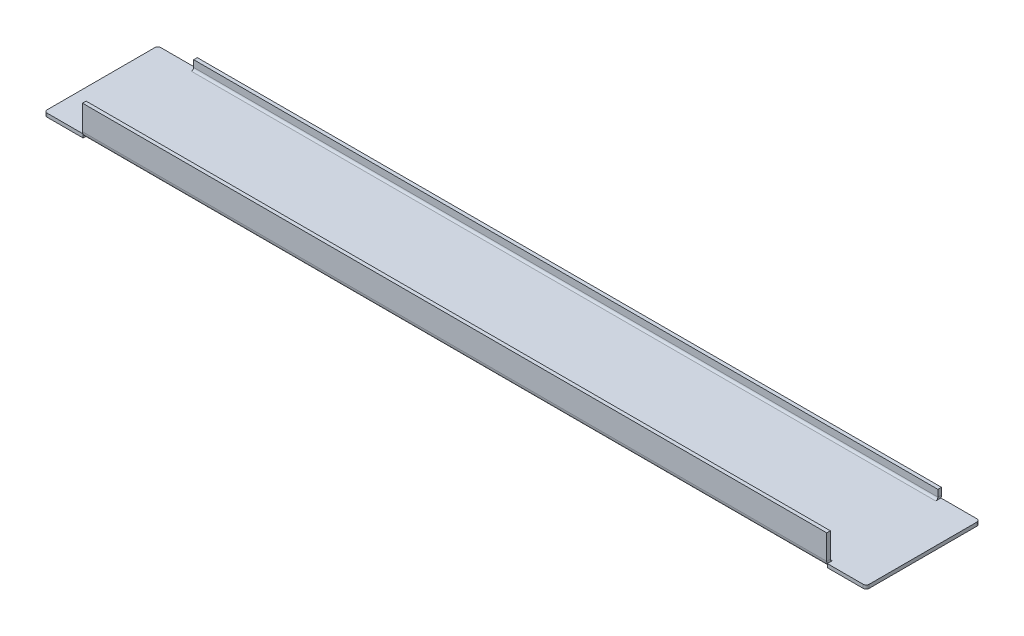
ISO-10303-21;
HEADER;
FILE_DESCRIPTION(('STEP AP214'),'2;1');
FILE_NAME('part.step','',(''),(''),'','','');
FILE_SCHEMA(('AUTOMOTIVE_DESIGN { 1 0 10303 214 1 1 1 1 }'));
ENDSEC;
DATA;
#1=APPLICATION_CONTEXT('core data for automotive mechanical design processes');
#2=APPLICATION_PROTOCOL_DEFINITION('international standard','automotive_design',2000,#1);
#3=PRODUCT_CONTEXT('',#1,'mechanical');
#4=PRODUCT('Part','Part','',(#3));
#5=PRODUCT_RELATED_PRODUCT_CATEGORY('part','',(#4));
#6=PRODUCT_DEFINITION_FORMATION('','',#4);
#7=PRODUCT_DEFINITION_CONTEXT('part definition',#1,'design');
#8=PRODUCT_DEFINITION('design','',#6,#7);
#9=PRODUCT_DEFINITION_SHAPE('','',#8);
#10=(LENGTH_UNIT() NAMED_UNIT(*) SI_UNIT(.MILLI.,.METRE.));
#11=(NAMED_UNIT(*) PLANE_ANGLE_UNIT() SI_UNIT($,.RADIAN.));
#12=(NAMED_UNIT(*) SI_UNIT($,.STERADIAN.) SOLID_ANGLE_UNIT());
#13=UNCERTAINTY_MEASURE_WITH_UNIT(LENGTH_MEASURE(1.E-05),#10,'distance_accuracy_value','');
#14=(GEOMETRIC_REPRESENTATION_CONTEXT(3) GLOBAL_UNCERTAINTY_ASSIGNED_CONTEXT((#13)) GLOBAL_UNIT_ASSIGNED_CONTEXT((#10,
#11,#12)) REPRESENTATION_CONTEXT('',''));
#15=CARTESIAN_POINT('',(0.,0.,0.));
#16=DIRECTION('',(0.,0.,1.));
#17=DIRECTION('',(1.,0.,0.));
#18=AXIS2_PLACEMENT_3D('',#15,#16,#17);
#19=CARTESIAN_POINT('',(-124.5,0.7366,17.2634));
#20=DIRECTION('',(-1.,0.,0.));
#21=DIRECTION('',(0.,0.,1.));
#22=AXIS2_PLACEMENT_3D('',#19,#20,#21);
#23=PLANE('',#22);
#24=CARTESIAN_POINT('',(-124.5,0.7366,17.2634));
#25=DIRECTION('',(1.,0.,0.));
#26=DIRECTION('',(0.,0.,-1.));
#27=AXIS2_PLACEMENT_3D('',#24,#25,#26);
#28=CIRCLE('',#27,0.7366);
#29=CARTESIAN_POINT('',(-124.5,0.7366,18.));
#30=VERTEX_POINT('',#29);
#31=CARTESIAN_POINT('',(-124.5,0.,17.2634));
#32=VERTEX_POINT('',#31);
#33=EDGE_CURVE('E301',#30,#32,#28,.T.);
#34=ORIENTED_EDGE('',*,*,#33,.T.);
#35=DIRECTION('',(0.,0.,-1.));
#36=VECTOR('',#35,1.);
#37=CARTESIAN_POINT('',(-124.5,0.,19.));
#38=LINE('',#37,#36);
#39=CARTESIAN_POINT('',(-124.5,0.,19.));
#40=VERTEX_POINT('',#39);
#41=EDGE_CURVE('E239',#40,#32,#38,.T.);
#42=ORIENTED_EDGE('',*,*,#41,.F.);
#43=DIRECTION('',(0.,1.,0.));
#44=VECTOR('',#43,1.);
#45=CARTESIAN_POINT('',(-124.5,-1.2,19.));
#46=LINE('',#45,#44);
#47=CARTESIAN_POINT('',(-124.5,-0.120511427995214,19.));
#48=VERTEX_POINT('',#47);
#49=EDGE_CURVE('E218',#48,#40,#46,.T.);
#50=ORIENTED_EDGE('',*,*,#49,.F.);
#51=CARTESIAN_POINT('',(-124.5,0.7366,17.2634));
#52=DIRECTION('',(-1.,0.,0.));
#53=DIRECTION('',(0.,0.,1.));
#54=AXIS2_PLACEMENT_3D('',#51,#52,#53);
#55=CIRCLE('',#54,1.9366);
#56=CARTESIAN_POINT('',(-124.5,0.736600000000001,19.2));
#57=VERTEX_POINT('',#56);
#58=EDGE_CURVE('E304',#57,#48,#55,.F.);
#59=ORIENTED_EDGE('',*,*,#58,.F.);
#60=DIRECTION('',(0.,0.,-1.));
#61=VECTOR('',#60,1.);
#62=CARTESIAN_POINT('',(-124.5,0.7366,18.));
#63=LINE('',#62,#61);
#64=EDGE_CURVE('E314',#30,#57,#63,.F.);
#65=ORIENTED_EDGE('',*,*,#64,.F.);
#66=EDGE_LOOP('',(#34,#42,#50,#59,#65));
#67=FACE_BOUND('',#66,.T.);
#68=ADVANCED_FACE('F34',(#67),#23,.T.);
#69=CARTESIAN_POINT('',(-124.5,0.7366,-17.2634));
#70=DIRECTION('',(-1.,0.,0.));
#71=DIRECTION('',(0.,0.,1.));
#72=AXIS2_PLACEMENT_3D('',#69,#70,#71);
#73=PLANE('',#72);
#74=DIRECTION('',(0.,1.,0.));
#75=VECTOR('',#74,1.);
#76=CARTESIAN_POINT('',(-124.5,0.7366,-19.));
#77=LINE('',#76,#75);
#78=CARTESIAN_POINT('',(-124.5,-0.120511427995214,-19.));
#79=VERTEX_POINT('',#78);
#80=CARTESIAN_POINT('',(-124.5,0.,-19.));
#81=VERTEX_POINT('',#80);
#82=EDGE_CURVE('E380',#79,#81,#77,.T.);
#83=ORIENTED_EDGE('',*,*,#82,.T.);
#84=DIRECTION('',(0.,0.,1.));
#85=VECTOR('',#84,1.);
#86=CARTESIAN_POINT('',(-124.5,0.,-17.2634));
#87=LINE('',#86,#85);
#88=CARTESIAN_POINT('',(-124.5,0.,-17.2634));
#89=VERTEX_POINT('',#88);
#90=EDGE_CURVE('E383',#81,#89,#87,.T.);
#91=ORIENTED_EDGE('',*,*,#90,.T.);
#92=CARTESIAN_POINT('',(-124.5,0.7366,-17.2634));
#93=DIRECTION('',(1.,0.,0.));
#94=DIRECTION('',(0.,0.,-1.));
#95=AXIS2_PLACEMENT_3D('',#92,#93,#94);
#96=CIRCLE('',#95,0.7366);
#97=CARTESIAN_POINT('',(-124.5,0.7366,-18.));
#98=VERTEX_POINT('',#97);
#99=EDGE_CURVE('E283',#89,#98,#96,.T.);
#100=ORIENTED_EDGE('',*,*,#99,.T.);
#101=DIRECTION('',(0.,0.,1.));
#102=VECTOR('',#101,1.);
#103=CARTESIAN_POINT('',(-124.5,0.7366,-18.));
#104=LINE('',#103,#102);
#105=CARTESIAN_POINT('',(-124.5,0.736599999999998,-19.2));
#106=VERTEX_POINT('',#105);
#107=EDGE_CURVE('E295',#98,#106,#104,.F.);
#108=ORIENTED_EDGE('',*,*,#107,.T.);
#109=CARTESIAN_POINT('',(-124.5,0.7366,-17.2634));
#110=DIRECTION('',(-1.,0.,0.));
#111=DIRECTION('',(0.,0.,1.));
#112=AXIS2_PLACEMENT_3D('',#109,#110,#111);
#113=CIRCLE('',#112,1.9366);
#114=EDGE_CURVE('E289',#79,#106,#113,.F.);
#115=ORIENTED_EDGE('',*,*,#114,.F.);
#116=EDGE_LOOP('',(#83,#91,#100,#108,#115));
#117=FACE_BOUND('',#116,.T.);
#118=ADVANCED_FACE('F436',(#117),#73,.T.);
#119=CARTESIAN_POINT('',(124.5,0.7366,17.2634));
#120=DIRECTION('',(1.,0.,0.));
#121=DIRECTION('',(0.,0.,-1.));
#122=AXIS2_PLACEMENT_3D('',#119,#120,#121);
#123=PLANE('',#122);
#124=DIRECTION('',(0.,-1.,0.));
#125=VECTOR('',#124,1.);
#126=CARTESIAN_POINT('',(124.5,0.,19.));
#127=LINE('',#126,#125);
#128=CARTESIAN_POINT('',(124.5,0.,19.));
#129=VERTEX_POINT('',#128);
#130=CARTESIAN_POINT('',(124.5,-0.120511427995214,19.));
#131=VERTEX_POINT('',#130);
#132=EDGE_CURVE('E250',#129,#131,#127,.T.);
#133=ORIENTED_EDGE('',*,*,#132,.F.);
#134=DIRECTION('',(0.,0.,-1.));
#135=VECTOR('',#134,1.);
#136=CARTESIAN_POINT('',(124.5,0.,19.));
#137=LINE('',#136,#135);
#138=CARTESIAN_POINT('',(124.5,0.,17.2634));
#139=VERTEX_POINT('',#138);
#140=EDGE_CURVE('E263',#129,#139,#137,.T.);
#141=ORIENTED_EDGE('',*,*,#140,.T.);
#142=CARTESIAN_POINT('',(124.5,0.7366,17.2634));
#143=DIRECTION('',(-1.,0.,0.));
#144=DIRECTION('',(0.,0.,1.));
#145=AXIS2_PLACEMENT_3D('',#142,#143,#144);
#146=CIRCLE('',#145,0.7366);
#147=CARTESIAN_POINT('',(124.5,0.7366,18.));
#148=VERTEX_POINT('',#147);
#149=EDGE_CURVE('E320',#139,#148,#146,.T.);
#150=ORIENTED_EDGE('',*,*,#149,.T.);
#151=DIRECTION('',(0.,0.,1.));
#152=VECTOR('',#151,1.);
#153=CARTESIAN_POINT('',(124.5,0.7366,19.2));
#154=LINE('',#153,#152);
#155=CARTESIAN_POINT('',(124.5,0.7366,19.2));
#156=VERTEX_POINT('',#155);
#157=EDGE_CURVE('E329',#156,#148,#154,.F.);
#158=ORIENTED_EDGE('',*,*,#157,.F.);
#159=CARTESIAN_POINT('',(124.5,0.7366,17.2634));
#160=DIRECTION('',(-1.,0.,0.));
#161=DIRECTION('',(0.,0.,1.));
#162=AXIS2_PLACEMENT_3D('',#159,#160,#161);
#163=CIRCLE('',#162,1.9366);
#164=EDGE_CURVE('E317',#131,#156,#163,.T.);
#165=ORIENTED_EDGE('',*,*,#164,.F.);
#166=EDGE_LOOP('',(#133,#141,#150,#158,#165));
#167=FACE_BOUND('',#166,.T.);
#168=ADVANCED_FACE('F442',(#167),#123,.T.);
#169=CARTESIAN_POINT('',(124.5,0.7366,-17.2634));
#170=DIRECTION('',(1.,0.,0.));
#171=DIRECTION('',(0.,0.,-1.));
#172=AXIS2_PLACEMENT_3D('',#169,#170,#171);
#173=PLANE('',#172);
#174=CARTESIAN_POINT('',(124.5,0.7366,-17.2634));
#175=DIRECTION('',(-1.,0.,0.));
#176=DIRECTION('',(0.,0.,1.));
#177=AXIS2_PLACEMENT_3D('',#174,#175,#176);
#178=CIRCLE('',#177,0.7366);
#179=CARTESIAN_POINT('',(124.5,0.736599999999999,-18.));
#180=VERTEX_POINT('',#179);
#181=CARTESIAN_POINT('',(124.5,0.,-17.2634));
#182=VERTEX_POINT('',#181);
#183=EDGE_CURVE('E269',#180,#182,#178,.T.);
#184=ORIENTED_EDGE('',*,*,#183,.T.);
#185=CARTESIAN_POINT('',(124.5,0.,-19.));
#186=VERTEX_POINT('',#185);
#187=EDGE_CURVE('E262',#182,#186,#137,.T.);
#188=ORIENTED_EDGE('',*,*,#187,.T.);
#189=DIRECTION('',(0.,-1.,0.));
#190=VECTOR('',#189,1.);
#191=CARTESIAN_POINT('',(124.5,0.,-19.));
#192=LINE('',#191,#190);
#193=CARTESIAN_POINT('',(124.5,-0.120511427995214,-19.));
#194=VERTEX_POINT('',#193);
#195=EDGE_CURVE('E247',#186,#194,#192,.T.);
#196=ORIENTED_EDGE('',*,*,#195,.T.);
#197=CARTESIAN_POINT('',(124.5,0.7366,-17.2634));
#198=DIRECTION('',(-1.,0.,0.));
#199=DIRECTION('',(0.,0.,1.));
#200=AXIS2_PLACEMENT_3D('',#197,#198,#199);
#201=CIRCLE('',#200,1.9366);
#202=CARTESIAN_POINT('',(124.5,0.736599999999998,-19.2));
#203=VERTEX_POINT('',#202);
#204=EDGE_CURVE('E268',#203,#194,#201,.T.);
#205=ORIENTED_EDGE('',*,*,#204,.F.);
#206=DIRECTION('',(0.,0.,-1.));
#207=VECTOR('',#206,1.);
#208=CARTESIAN_POINT('',(124.5,0.736599999999998,-19.2));
#209=LINE('',#208,#207);
#210=EDGE_CURVE('E280',#203,#180,#209,.F.);
#211=ORIENTED_EDGE('',*,*,#210,.T.);
#212=EDGE_LOOP('',(#184,#188,#196,#205,#211));
#213=FACE_BOUND('',#212,.T.);
#214=ADVANCED_FACE('F455',(#213),#173,.T.);
#215=CARTESIAN_POINT('',(137.5,0.,-19.2));
#216=DIRECTION('',(0.,0.,1.));
#217=DIRECTION('',(0.,-1.,0.));
#218=AXIS2_PLACEMENT_3D('',#215,#216,#217);
#219=PLANE('',#218);
#220=DIRECTION('',(0.,-1.,0.));
#221=VECTOR('',#220,1.);
#222=CARTESIAN_POINT('',(124.5,0.,-19.2));
#223=LINE('',#222,#221);
#224=CARTESIAN_POINT('',(124.5,3.,-19.2));
#225=VERTEX_POINT('',#224);
#226=EDGE_CURVE('E272',#225,#203,#223,.T.);
#227=ORIENTED_EDGE('',*,*,#226,.T.);
#228=DIRECTION('',(-1.,0.,0.));
#229=VECTOR('',#228,1.);
#230=CARTESIAN_POINT('',(137.5,0.736599999999998,-19.2));
#231=LINE('',#230,#229);
#232=EDGE_CURVE('E345',#203,#106,#231,.T.);
#233=ORIENTED_EDGE('',*,*,#232,.T.);
#234=DIRECTION('',(0.,-1.,0.));
#235=VECTOR('',#234,1.);
#236=CARTESIAN_POINT('',(-124.5,0.,-19.2));
#237=LINE('',#236,#235);
#238=CARTESIAN_POINT('',(-124.5,3.,-19.2));
#239=VERTEX_POINT('',#238);
#240=EDGE_CURVE('E292',#106,#239,#237,.F.);
#241=ORIENTED_EDGE('',*,*,#240,.T.);
#242=DIRECTION('',(-1.,0.,0.));
#243=VECTOR('',#242,1.);
#244=CARTESIAN_POINT('',(137.5,3.,-19.2));
#245=LINE('',#244,#243);
#246=EDGE_CURVE('E378',#225,#239,#245,.T.);
#247=ORIENTED_EDGE('',*,*,#246,.F.);
#248=EDGE_LOOP('',(#227,#233,#241,#247));
#249=FACE_BOUND('',#248,.T.);
#250=ADVANCED_FACE('F500',(#249),#219,.F.);
#251=CARTESIAN_POINT('',(137.5,3.,-18.));
#252=DIRECTION('',(0.,1.,0.));
#253=DIRECTION('',(0.,0.,1.));
#254=AXIS2_PLACEMENT_3D('',#251,#252,#253);
#255=PLANE('',#254);
#256=DIRECTION('',(-1.,0.,0.));
#257=VECTOR('',#256,1.);
#258=CARTESIAN_POINT('',(137.5,3.,-18.));
#259=LINE('',#258,#257);
#260=CARTESIAN_POINT('',(124.5,3.,-18.));
#261=VERTEX_POINT('',#260);
#262=CARTESIAN_POINT('',(-124.5,3.,-18.));
#263=VERTEX_POINT('',#262);
#264=EDGE_CURVE('E376',#261,#263,#259,.T.);
#265=ORIENTED_EDGE('',*,*,#264,.F.);
#266=DIRECTION('',(0.,0.,-1.));
#267=VECTOR('',#266,1.);
#268=CARTESIAN_POINT('',(124.5,3.,-19.2));
#269=LINE('',#268,#267);
#270=EDGE_CURVE('E277',#225,#261,#269,.F.);
#271=ORIENTED_EDGE('',*,*,#270,.F.);
#272=ORIENTED_EDGE('',*,*,#246,.T.);
#273=DIRECTION('',(0.,0.,1.));
#274=VECTOR('',#273,1.);
#275=CARTESIAN_POINT('',(-124.5,3.,-18.));
#276=LINE('',#275,#274);
#277=EDGE_CURVE('E298',#263,#239,#276,.F.);
#278=ORIENTED_EDGE('',*,*,#277,.F.);
#279=EDGE_LOOP('',(#265,#271,#272,#278));
#280=FACE_BOUND('',#279,.T.);
#281=ADVANCED_FACE('F496',(#280),#255,.T.);
#282=CARTESIAN_POINT('',(137.5,0.,-18.));
#283=DIRECTION('',(0.,0.,1.));
#284=DIRECTION('',(0.,-1.,0.));
#285=AXIS2_PLACEMENT_3D('',#282,#283,#284);
#286=PLANE('',#285);
#287=DIRECTION('',(-1.,0.,0.));
#288=VECTOR('',#287,1.);
#289=CARTESIAN_POINT('',(137.5,0.736599999999999,-18.));
#290=LINE('',#289,#288);
#291=EDGE_CURVE('E374',#180,#98,#290,.T.);
#292=ORIENTED_EDGE('',*,*,#291,.F.);
#293=DIRECTION('',(0.,-1.,0.));
#294=VECTOR('',#293,1.);
#295=CARTESIAN_POINT('',(124.5,0.,-18.));
#296=LINE('',#295,#294);
#297=EDGE_CURVE('E275',#261,#180,#296,.T.);
#298=ORIENTED_EDGE('',*,*,#297,.F.);
#299=ORIENTED_EDGE('',*,*,#264,.T.);
#300=DIRECTION('',(0.,1.,0.));
#301=VECTOR('',#300,1.);
#302=CARTESIAN_POINT('',(-124.5,0.,-18.));
#303=LINE('',#302,#301);
#304=EDGE_CURVE('E288',#98,#263,#303,.T.);
#305=ORIENTED_EDGE('',*,*,#304,.F.);
#306=EDGE_LOOP('',(#292,#298,#299,#305));
#307=FACE_BOUND('',#306,.T.);
#308=ADVANCED_FACE('F492',(#307),#286,.T.);
#309=CARTESIAN_POINT('',(137.5,0.7366,-17.2634));
#310=DIRECTION('',(-1.,0.,0.));
#311=DIRECTION('',(0.,0.,1.));
#312=AXIS2_PLACEMENT_3D('',#309,#310,#311);
#313=CYLINDRICAL_SURFACE('',#312,0.7366);
#314=DIRECTION('',(-1.,0.,0.));
#315=VECTOR('',#314,1.);
#316=CARTESIAN_POINT('',(137.5,0.,-17.2634));
#317=LINE('',#316,#315);
#318=EDGE_CURVE('E371',#182,#89,#317,.T.);
#319=ORIENTED_EDGE('',*,*,#318,.F.);
#320=ORIENTED_EDGE('',*,*,#183,.F.);
#321=ORIENTED_EDGE('',*,*,#291,.T.);
#322=ORIENTED_EDGE('',*,*,#99,.F.);
#323=EDGE_LOOP('',(#319,#320,#321,#322));
#324=FACE_BOUND('',#323,.T.);
#325=ADVANCED_FACE('F464',(#324),#313,.F.);
#326=CARTESIAN_POINT('',(137.5,0.7366,-17.2634));
#327=DIRECTION('',(-1.,0.,0.));
#328=DIRECTION('',(0.,0.,1.));
#329=AXIS2_PLACEMENT_3D('',#326,#327,#328);
#330=CYLINDRICAL_SURFACE('',#329,1.9366);
#331=ORIENTED_EDGE('',*,*,#204,.T.);
#332=CARTESIAN_POINT('',(124.5,0.7366,-17.2634));
#333=DIRECTION('',(1.,0.,0.));
#334=DIRECTION('',(0.,0.,-1.));
#335=AXIS2_PLACEMENT_3D('',#332,#333,#334);
#336=CIRCLE('',#335,1.9366);
#337=CARTESIAN_POINT('',(124.5,-1.2,-17.2634));
#338=VERTEX_POINT('',#337);
#339=EDGE_CURVE('E266',#338,#194,#336,.T.);
#340=ORIENTED_EDGE('',*,*,#339,.F.);
#341=DIRECTION('',(-1.,0.,0.));
#342=VECTOR('',#341,1.);
#343=CARTESIAN_POINT('',(137.5,-1.2,-17.2634));
#344=LINE('',#343,#342);
#345=CARTESIAN_POINT('',(-124.5,-1.2,-17.2634));
#346=VERTEX_POINT('',#345);
#347=EDGE_CURVE('E352',#338,#346,#344,.T.);
#348=ORIENTED_EDGE('',*,*,#347,.T.);
#349=EDGE_CURVE('E285',#346,#79,#113,.F.);
#350=ORIENTED_EDGE('',*,*,#349,.T.);
#351=ORIENTED_EDGE('',*,*,#114,.T.);
#352=ORIENTED_EDGE('',*,*,#232,.F.);
#353=EDGE_LOOP('',(#331,#340,#348,#350,#351,#352));
#354=FACE_BOUND('',#353,.T.);
#355=ADVANCED_FACE('F460',(#354),#330,.T.);
#356=CARTESIAN_POINT('',(137.5,0.7366,17.2634));
#357=DIRECTION('',(-1.,0.,0.));
#358=DIRECTION('',(0.,0.,1.));
#359=AXIS2_PLACEMENT_3D('',#356,#357,#358);
#360=CYLINDRICAL_SURFACE('',#359,0.7366);
#361=DIRECTION('',(-1.,0.,0.));
#362=VECTOR('',#361,1.);
#363=CARTESIAN_POINT('',(137.5,0.,17.2634));
#364=LINE('',#363,#362);
#365=EDGE_CURVE('E368',#139,#32,#364,.T.);
#366=ORIENTED_EDGE('',*,*,#365,.T.);
#367=ORIENTED_EDGE('',*,*,#33,.F.);
#368=DIRECTION('',(-1.,0.,0.));
#369=VECTOR('',#368,1.);
#370=CARTESIAN_POINT('',(137.5,0.7366,18.));
#371=LINE('',#370,#369);
#372=EDGE_CURVE('E365',#148,#30,#371,.T.);
#373=ORIENTED_EDGE('',*,*,#372,.F.);
#374=ORIENTED_EDGE('',*,*,#149,.F.);
#375=EDGE_LOOP('',(#366,#367,#373,#374));
#376=FACE_BOUND('',#375,.T.);
#377=ADVANCED_FACE('F463',(#376),#360,.F.);
#378=CARTESIAN_POINT('',(137.5,9.,18.));
#379=DIRECTION('',(0.,0.,-1.));
#380=DIRECTION('',(-1.,0.,0.));
#381=AXIS2_PLACEMENT_3D('',#378,#379,#380);
#382=PLANE('',#381);
#383=ORIENTED_EDGE('',*,*,#372,.T.);
#384=DIRECTION('',(0.,-1.,0.));
#385=VECTOR('',#384,1.);
#386=CARTESIAN_POINT('',(-124.5,9.,18.));
#387=LINE('',#386,#385);
#388=CARTESIAN_POINT('',(-124.5,8.99999999999999,18.));
#389=VERTEX_POINT('',#388);
#390=EDGE_CURVE('E307',#389,#30,#387,.T.);
#391=ORIENTED_EDGE('',*,*,#390,.F.);
#392=DIRECTION('',(-1.,0.,0.));
#393=VECTOR('',#392,1.);
#394=CARTESIAN_POINT('',(137.5,9.,18.));
#395=LINE('',#394,#393);
#396=CARTESIAN_POINT('',(124.5,9.00000000000004,18.));
#397=VERTEX_POINT('',#396);
#398=EDGE_CURVE('E362',#397,#389,#395,.T.);
#399=ORIENTED_EDGE('',*,*,#398,.F.);
#400=DIRECTION('',(0.,1.,0.));
#401=VECTOR('',#400,1.);
#402=CARTESIAN_POINT('',(124.5,9.,18.));
#403=LINE('',#402,#401);
#404=EDGE_CURVE('E326',#397,#148,#403,.F.);
#405=ORIENTED_EDGE('',*,*,#404,.T.);
#406=EDGE_LOOP('',(#383,#391,#399,#405));
#407=FACE_BOUND('',#406,.T.);
#408=ADVANCED_FACE('F480',(#407),#382,.T.);
#409=CARTESIAN_POINT('',(137.5,9.,19.2));
#410=DIRECTION('',(0.,1.,0.));
#411=DIRECTION('',(0.,0.,1.));
#412=AXIS2_PLACEMENT_3D('',#409,#410,#411);
#413=PLANE('',#412);
#414=ORIENTED_EDGE('',*,*,#398,.T.);
#415=DIRECTION('',(0.,0.,-1.));
#416=VECTOR('',#415,1.);
#417=CARTESIAN_POINT('',(-124.5,8.99999999999999,18.));
#418=LINE('',#417,#416);
#419=CARTESIAN_POINT('',(-124.5,8.99999999999999,19.2));
#420=VERTEX_POINT('',#419);
#421=EDGE_CURVE('E312',#389,#420,#418,.F.);
#422=ORIENTED_EDGE('',*,*,#421,.T.);
#423=DIRECTION('',(-1.,0.,0.));
#424=VECTOR('',#423,1.);
#425=CARTESIAN_POINT('',(137.5,9.,19.2));
#426=LINE('',#425,#424);
#427=CARTESIAN_POINT('',(124.5,9.00000000000004,19.2));
#428=VERTEX_POINT('',#427);
#429=EDGE_CURVE('E359',#428,#420,#426,.T.);
#430=ORIENTED_EDGE('',*,*,#429,.F.);
#431=DIRECTION('',(0.,0.,1.));
#432=VECTOR('',#431,1.);
#433=CARTESIAN_POINT('',(124.5,9.00000000000004,19.2));
#434=LINE('',#433,#432);
#435=EDGE_CURVE('E332',#428,#397,#434,.F.);
#436=ORIENTED_EDGE('',*,*,#435,.T.);
#437=EDGE_LOOP('',(#414,#422,#430,#436));
#438=FACE_BOUND('',#437,.T.);
#439=ADVANCED_FACE('F476',(#438),#413,.T.);
#440=CARTESIAN_POINT('',(137.5,9.,19.2));
#441=DIRECTION('',(0.,0.,-1.));
#442=DIRECTION('',(-1.,0.,0.));
#443=AXIS2_PLACEMENT_3D('',#440,#441,#442);
#444=PLANE('',#443);
#445=DIRECTION('',(0.,1.,0.));
#446=VECTOR('',#445,1.);
#447=CARTESIAN_POINT('',(-124.5,9.,19.2));
#448=LINE('',#447,#446);
#449=EDGE_CURVE('E309',#420,#57,#448,.F.);
#450=ORIENTED_EDGE('',*,*,#449,.T.);
#451=DIRECTION('',(-1.,0.,0.));
#452=VECTOR('',#451,1.);
#453=CARTESIAN_POINT('',(137.5,0.7366,19.2));
#454=LINE('',#453,#452);
#455=EDGE_CURVE('E356',#156,#57,#454,.T.);
#456=ORIENTED_EDGE('',*,*,#455,.F.);
#457=DIRECTION('',(0.,-1.,0.));
#458=VECTOR('',#457,1.);
#459=CARTESIAN_POINT('',(124.5,0.,19.2));
#460=LINE('',#459,#458);
#461=EDGE_CURVE('E322',#428,#156,#460,.T.);
#462=ORIENTED_EDGE('',*,*,#461,.F.);
#463=ORIENTED_EDGE('',*,*,#429,.T.);
#464=EDGE_LOOP('',(#450,#456,#462,#463));
#465=FACE_BOUND('',#464,.T.);
#466=ADVANCED_FACE('F472',(#465),#444,.F.);
#467=CARTESIAN_POINT('',(137.5,0.7366,17.2634));
#468=DIRECTION('',(-1.,0.,0.));
#469=DIRECTION('',(0.,0.,1.));
#470=AXIS2_PLACEMENT_3D('',#467,#468,#469);
#471=CYLINDRICAL_SURFACE('',#470,1.9366);
#472=ORIENTED_EDGE('',*,*,#58,.T.);
#473=CARTESIAN_POINT('',(-124.5,0.7366,17.2634));
#474=DIRECTION('',(-1.,0.,0.));
#475=DIRECTION('',(0.,-1.,0.));
#476=AXIS2_PLACEMENT_3D('',#473,#474,#475);
#477=CIRCLE('',#476,1.9366);
#478=CARTESIAN_POINT('',(-124.5,-1.2,17.2634));
#479=VERTEX_POINT('',#478);
#480=EDGE_CURVE('E226',#479,#48,#477,.T.);
#481=ORIENTED_EDGE('',*,*,#480,.F.);
#482=DIRECTION('',(-1.,0.,0.));
#483=VECTOR('',#482,1.);
#484=CARTESIAN_POINT('',(137.5,-1.2,17.2634));
#485=LINE('',#484,#483);
#486=CARTESIAN_POINT('',(124.5,-1.2,17.2634));
#487=VERTEX_POINT('',#486);
#488=EDGE_CURVE('E233',#487,#479,#485,.T.);
#489=ORIENTED_EDGE('',*,*,#488,.F.);
#490=EDGE_CURVE('E323',#487,#131,#163,.T.);
#491=ORIENTED_EDGE('',*,*,#490,.T.);
#492=ORIENTED_EDGE('',*,*,#164,.T.);
#493=ORIENTED_EDGE('',*,*,#455,.T.);
#494=EDGE_LOOP('',(#472,#481,#489,#491,#492,#493));
#495=FACE_BOUND('',#494,.T.);
#496=ADVANCED_FACE('F468',(#495),#471,.T.);
#497=CARTESIAN_POINT('',(137.5,0.7366,19.2));
#498=DIRECTION('',(1.,0.,0.));
#499=DIRECTION('',(0.,0.,-1.));
#500=AXIS2_PLACEMENT_3D('',#497,#498,#499);
#501=PLANE('',#500);
#502=DIRECTION('',(0.,0.,-1.));
#503=VECTOR('',#502,1.);
#504=CARTESIAN_POINT('',(137.5,0.,18.));
#505=LINE('',#504,#503);
#506=CARTESIAN_POINT('',(137.5,0.,18.));
#507=VERTEX_POINT('',#506);
#508=CARTESIAN_POINT('',(137.5,0.,-18.));
#509=VERTEX_POINT('',#508);
#510=EDGE_CURVE('E338',#507,#509,#505,.T.);
#511=ORIENTED_EDGE('',*,*,#510,.F.);
#512=DIRECTION('',(0.,1.,0.));
#513=VECTOR('',#512,1.);
#514=CARTESIAN_POINT('',(137.5,0.7366,18.));
#515=LINE('',#514,#513);
#516=CARTESIAN_POINT('',(137.5,-1.2,18.));
#517=VERTEX_POINT('',#516);
#518=EDGE_CURVE('E399',#507,#517,#515,.F.);
#519=ORIENTED_EDGE('',*,*,#518,.T.);
#520=DIRECTION('',(0.,0.,-1.));
#521=VECTOR('',#520,1.);
#522=CARTESIAN_POINT('',(137.5,-1.2,18.));
#523=LINE('',#522,#521);
#524=CARTESIAN_POINT('',(137.5,-1.2,-18.));
#525=VERTEX_POINT('',#524);
#526=EDGE_CURVE('E341',#517,#525,#523,.T.);
#527=ORIENTED_EDGE('',*,*,#526,.T.);
#528=DIRECTION('',(0.,1.,0.));
#529=VECTOR('',#528,1.);
#530=CARTESIAN_POINT('',(137.5,0.,-18.));
#531=LINE('',#530,#529);
#532=EDGE_CURVE('E396',#525,#509,#531,.T.);
#533=ORIENTED_EDGE('',*,*,#532,.T.);
#534=EDGE_LOOP('',(#511,#519,#527,#533));
#535=FACE_BOUND('',#534,.T.);
#536=ADVANCED_FACE('F471',(#535),#501,.T.);
#537=CARTESIAN_POINT('',(-137.5,0.736599999999998,-19.2));
#538=DIRECTION('',(-1.,0.,0.));
#539=DIRECTION('',(0.,0.,1.));
#540=AXIS2_PLACEMENT_3D('',#537,#538,#539);
#541=PLANE('',#540);
#542=DIRECTION('',(0.,0.,-1.));
#543=VECTOR('',#542,1.);
#544=CARTESIAN_POINT('',(-137.5,-1.2,18.));
#545=LINE('',#544,#543);
#546=CARTESIAN_POINT('',(-137.5,-1.2,18.));
#547=VERTEX_POINT('',#546);
#548=CARTESIAN_POINT('',(-137.5,-1.2,-18.));
#549=VERTEX_POINT('',#548);
#550=EDGE_CURVE('E342',#547,#549,#545,.T.);
#551=ORIENTED_EDGE('',*,*,#550,.F.);
#552=DIRECTION('',(0.,-1.,0.));
#553=VECTOR('',#552,1.);
#554=CARTESIAN_POINT('',(-137.5,0.736599999999998,18.));
#555=LINE('',#554,#553);
#556=CARTESIAN_POINT('',(-137.5,0.,18.));
#557=VERTEX_POINT('',#556);
#558=EDGE_CURVE('E42',#547,#557,#555,.F.);
#559=ORIENTED_EDGE('',*,*,#558,.T.);
#560=DIRECTION('',(0.,0.,-1.));
#561=VECTOR('',#560,1.);
#562=CARTESIAN_POINT('',(-137.5,0.,18.));
#563=LINE('',#562,#561);
#564=CARTESIAN_POINT('',(-137.5,0.,-18.));
#565=VERTEX_POINT('',#564);
#566=EDGE_CURVE('E335',#557,#565,#563,.T.);
#567=ORIENTED_EDGE('',*,*,#566,.T.);
#568=DIRECTION('',(0.,-1.,0.));
#569=VECTOR('',#568,1.);
#570=CARTESIAN_POINT('',(-137.5,-1.2,-18.));
#571=LINE('',#570,#569);
#572=EDGE_CURVE('E410',#565,#549,#571,.T.);
#573=ORIENTED_EDGE('',*,*,#572,.T.);
#574=EDGE_LOOP('',(#551,#559,#567,#573));
#575=FACE_BOUND('',#574,.T.);
#576=ADVANCED_FACE('F415',(#575),#541,.T.);
#577=CARTESIAN_POINT('',(137.5,0.,18.));
#578=DIRECTION('',(0.,1.,0.));
#579=DIRECTION('',(0.,0.,1.));
#580=AXIS2_PLACEMENT_3D('',#577,#578,#579);
#581=PLANE('',#580);
#582=DIRECTION('',(-1.,0.,0.));
#583=VECTOR('',#582,1.);
#584=CARTESIAN_POINT('',(137.5,0.,19.));
#585=LINE('',#584,#583);
#586=CARTESIAN_POINT('',(136.5,0.,19.));
#587=VERTEX_POINT('',#586);
#588=EDGE_CURVE('E246',#587,#129,#585,.T.);
#589=ORIENTED_EDGE('',*,*,#588,.F.);
#590=CARTESIAN_POINT('',(136.5,0.,18.));
#591=DIRECTION('',(0.,1.,0.));
#592=DIRECTION('',(0.,0.,1.));
#593=AXIS2_PLACEMENT_3D('',#590,#591,#592);
#594=CIRCLE('',#593,1.);
#595=EDGE_CURVE('E394',#587,#507,#594,.T.);
#596=ORIENTED_EDGE('',*,*,#595,.T.);
#597=ORIENTED_EDGE('',*,*,#510,.T.);
#598=CARTESIAN_POINT('',(136.5,0.,-18.));
#599=DIRECTION('',(0.,1.,0.));
#600=DIRECTION('',(0.,0.,1.));
#601=AXIS2_PLACEMENT_3D('',#598,#599,#600);
#602=CIRCLE('',#601,1.);
#603=CARTESIAN_POINT('',(136.5,0.,-19.));
#604=VERTEX_POINT('',#603);
#605=EDGE_CURVE('E392',#509,#604,#602,.T.);
#606=ORIENTED_EDGE('',*,*,#605,.T.);
#607=DIRECTION('',(-1.,0.,0.));
#608=VECTOR('',#607,1.);
#609=CARTESIAN_POINT('',(137.5,0.,-19.));
#610=LINE('',#609,#608);
#611=EDGE_CURVE('E255',#604,#186,#610,.T.);
#612=ORIENTED_EDGE('',*,*,#611,.T.);
#613=ORIENTED_EDGE('',*,*,#187,.F.);
#614=ORIENTED_EDGE('',*,*,#318,.T.);
#615=ORIENTED_EDGE('',*,*,#90,.F.);
#616=DIRECTION('',(-1.,0.,0.));
#617=VECTOR('',#616,1.);
#618=CARTESIAN_POINT('',(-124.5,0.,-19.));
#619=LINE('',#618,#617);
#620=CARTESIAN_POINT('',(-136.5,0.,-19.));
#621=VERTEX_POINT('',#620);
#622=EDGE_CURVE('E219',#81,#621,#619,.T.);
#623=ORIENTED_EDGE('',*,*,#622,.T.);
#624=CARTESIAN_POINT('',(-136.5,0.,-18.));
#625=DIRECTION('',(0.,1.,0.));
#626=DIRECTION('',(0.,0.,1.));
#627=AXIS2_PLACEMENT_3D('',#624,#625,#626);
#628=CIRCLE('',#627,1.);
#629=EDGE_CURVE('E388',#621,#565,#628,.T.);
#630=ORIENTED_EDGE('',*,*,#629,.T.);
#631=ORIENTED_EDGE('',*,*,#566,.F.);
#632=CARTESIAN_POINT('',(-136.5,0.,18.));
#633=DIRECTION('',(0.,1.,0.));
#634=DIRECTION('',(0.,0.,1.));
#635=AXIS2_PLACEMENT_3D('',#632,#633,#634);
#636=CIRCLE('',#635,1.);
#637=CARTESIAN_POINT('',(-136.5,0.,19.));
#638=VERTEX_POINT('',#637);
#639=EDGE_CURVE('E390',#557,#638,#636,.T.);
#640=ORIENTED_EDGE('',*,*,#639,.T.);
#641=DIRECTION('',(-1.,0.,0.));
#642=VECTOR('',#641,1.);
#643=CARTESIAN_POINT('',(-124.5,0.,19.));
#644=LINE('',#643,#642);
#645=EDGE_CURVE('E227',#40,#638,#644,.T.);
#646=ORIENTED_EDGE('',*,*,#645,.F.);
#647=ORIENTED_EDGE('',*,*,#41,.T.);
#648=ORIENTED_EDGE('',*,*,#365,.F.);
#649=ORIENTED_EDGE('',*,*,#140,.F.);
#650=EDGE_LOOP('',(#589,#596,#597,#606,#612,#613,#614,#615,#623,#630,#631,#640,#646,#647,#648,#649));
#651=FACE_BOUND('',#650,.T.);
#652=ADVANCED_FACE('F420',(#651),#581,.T.);
#653=CARTESIAN_POINT('',(137.5,-1.2,18.));
#654=DIRECTION('',(0.,1.,0.));
#655=DIRECTION('',(0.,0.,1.));
#656=AXIS2_PLACEMENT_3D('',#653,#654,#655);
#657=PLANE('',#656);
#658=ORIENTED_EDGE('',*,*,#526,.F.);
#659=CARTESIAN_POINT('',(136.5,-1.2,18.));
#660=DIRECTION('',(0.,1.,0.));
#661=DIRECTION('',(0.,0.,1.));
#662=AXIS2_PLACEMENT_3D('',#659,#660,#661);
#663=CIRCLE('',#662,1.);
#664=CARTESIAN_POINT('',(136.5,-1.2,19.));
#665=VERTEX_POINT('',#664);
#666=EDGE_CURVE('E406',#517,#665,#663,.F.);
#667=ORIENTED_EDGE('',*,*,#666,.T.);
#668=DIRECTION('',(1.,0.,0.));
#669=VECTOR('',#668,1.);
#670=CARTESIAN_POINT('',(124.5,-1.2,19.));
#671=LINE('',#670,#669);
#672=CARTESIAN_POINT('',(124.5,-1.2,19.));
#673=VERTEX_POINT('',#672);
#674=EDGE_CURVE('E243',#673,#665,#671,.T.);
#675=ORIENTED_EDGE('',*,*,#674,.F.);
#676=DIRECTION('',(0.,0.,-1.));
#677=VECTOR('',#676,1.);
#678=CARTESIAN_POINT('',(124.5,-1.2,19.));
#679=LINE('',#678,#677);
#680=EDGE_CURVE('E260',#673,#487,#679,.T.);
#681=ORIENTED_EDGE('',*,*,#680,.T.);
#682=ORIENTED_EDGE('',*,*,#488,.T.);
#683=DIRECTION('',(0.,0.,-1.));
#684=VECTOR('',#683,1.);
#685=CARTESIAN_POINT('',(-124.5,-1.2,19.));
#686=LINE('',#685,#684);
#687=CARTESIAN_POINT('',(-124.5,-1.2,19.));
#688=VERTEX_POINT('',#687);
#689=EDGE_CURVE('E225',#688,#479,#686,.T.);
#690=ORIENTED_EDGE('',*,*,#689,.F.);
#691=DIRECTION('',(1.,0.,0.));
#692=VECTOR('',#691,1.);
#693=CARTESIAN_POINT('',(-137.5,-1.2,19.));
#694=LINE('',#693,#692);
#695=CARTESIAN_POINT('',(-136.5,-1.2,19.));
#696=VERTEX_POINT('',#695);
#697=EDGE_CURVE('E209',#696,#688,#694,.T.);
#698=ORIENTED_EDGE('',*,*,#697,.F.);
#699=CARTESIAN_POINT('',(-136.5,-1.2,18.));
#700=DIRECTION('',(0.,1.,0.));
#701=DIRECTION('',(0.,0.,1.));
#702=AXIS2_PLACEMENT_3D('',#699,#700,#701);
#703=CIRCLE('',#702,1.);
#704=EDGE_CURVE('E49',#696,#547,#703,.F.);
#705=ORIENTED_EDGE('',*,*,#704,.T.);
#706=ORIENTED_EDGE('',*,*,#550,.T.);
#707=CARTESIAN_POINT('',(-136.5,-1.2,-18.));
#708=DIRECTION('',(0.,1.,0.));
#709=DIRECTION('',(0.,0.,1.));
#710=AXIS2_PLACEMENT_3D('',#707,#708,#709);
#711=CIRCLE('',#710,1.);
#712=CARTESIAN_POINT('',(-136.5,-1.2,-19.));
#713=VERTEX_POINT('',#712);
#714=EDGE_CURVE('E401',#549,#713,#711,.F.);
#715=ORIENTED_EDGE('',*,*,#714,.T.);
#716=DIRECTION('',(1.,0.,0.));
#717=VECTOR('',#716,1.);
#718=CARTESIAN_POINT('',(-137.5,-1.2,-19.));
#719=LINE('',#718,#717);
#720=CARTESIAN_POINT('',(-124.5,-1.2,-19.));
#721=VERTEX_POINT('',#720);
#722=EDGE_CURVE('E540',#713,#721,#719,.T.);
#723=ORIENTED_EDGE('',*,*,#722,.T.);
#724=EDGE_CURVE('E234',#346,#721,#686,.T.);
#725=ORIENTED_EDGE('',*,*,#724,.F.);
#726=ORIENTED_EDGE('',*,*,#347,.F.);
#727=CARTESIAN_POINT('',(124.5,-1.2,-19.));
#728=VERTEX_POINT('',#727);
#729=EDGE_CURVE('E253',#338,#728,#679,.T.);
#730=ORIENTED_EDGE('',*,*,#729,.T.);
#731=DIRECTION('',(1.,0.,0.));
#732=VECTOR('',#731,1.);
#733=CARTESIAN_POINT('',(124.5,-1.2,-19.));
#734=LINE('',#733,#732);
#735=CARTESIAN_POINT('',(136.5,-1.2,-19.));
#736=VERTEX_POINT('',#735);
#737=EDGE_CURVE('E236',#728,#736,#734,.T.);
#738=ORIENTED_EDGE('',*,*,#737,.T.);
#739=CARTESIAN_POINT('',(136.5,-1.2,-18.));
#740=DIRECTION('',(0.,1.,0.));
#741=DIRECTION('',(0.,0.,1.));
#742=AXIS2_PLACEMENT_3D('',#739,#740,#741);
#743=CIRCLE('',#742,1.);
#744=EDGE_CURVE('E404',#736,#525,#743,.F.);
#745=ORIENTED_EDGE('',*,*,#744,.T.);
#746=EDGE_LOOP('',(#658,#667,#675,#681,#682,#690,#698,#705,#706,#715,#723,#725,#726,#730,#738,#745));
#747=FACE_BOUND('',#746,.T.);
#748=ADVANCED_FACE('F231',(#747),#657,.F.);
#749=CARTESIAN_POINT('',(124.5,0.,19.2));
#750=DIRECTION('',(1.,0.,0.));
#751=DIRECTION('',(0.,-1.,0.));
#752=AXIS2_PLACEMENT_3D('',#749,#750,#751);
#753=PLANE('',#752);
#754=ORIENTED_EDGE('',*,*,#435,.F.);
#755=ORIENTED_EDGE('',*,*,#461,.T.);
#756=ORIENTED_EDGE('',*,*,#157,.T.);
#757=ORIENTED_EDGE('',*,*,#404,.F.);
#758=EDGE_LOOP('',(#754,#755,#756,#757));
#759=FACE_BOUND('',#758,.T.);
#760=ADVANCED_FACE('F451',(#759),#753,.T.);
#761=CARTESIAN_POINT('',(-124.5,9.,18.));
#762=DIRECTION('',(1.,0.,0.));
#763=DIRECTION('',(0.,-1.,0.));
#764=AXIS2_PLACEMENT_3D('',#761,#762,#763);
#765=PLANE('',#764);
#766=ORIENTED_EDGE('',*,*,#390,.T.);
#767=ORIENTED_EDGE('',*,*,#64,.T.);
#768=ORIENTED_EDGE('',*,*,#449,.F.);
#769=ORIENTED_EDGE('',*,*,#421,.F.);
#770=EDGE_LOOP('',(#766,#767,#768,#769));
#771=FACE_BOUND('',#770,.T.);
#772=ADVANCED_FACE('F448',(#771),#765,.F.);
#773=CARTESIAN_POINT('',(-124.5,0.,-18.));
#774=DIRECTION('',(1.,0.,0.));
#775=DIRECTION('',(0.,1.,0.));
#776=AXIS2_PLACEMENT_3D('',#773,#774,#775);
#777=PLANE('',#776);
#778=ORIENTED_EDGE('',*,*,#304,.T.);
#779=ORIENTED_EDGE('',*,*,#277,.T.);
#780=ORIENTED_EDGE('',*,*,#240,.F.);
#781=ORIENTED_EDGE('',*,*,#107,.F.);
#782=EDGE_LOOP('',(#778,#779,#780,#781));
#783=FACE_BOUND('',#782,.T.);
#784=ADVANCED_FACE('F447',(#783),#777,.F.);
#785=CARTESIAN_POINT('',(124.5,0.,-19.2));
#786=DIRECTION('',(-1.,0.,0.));
#787=DIRECTION('',(0.,-1.,0.));
#788=AXIS2_PLACEMENT_3D('',#785,#786,#787);
#789=PLANE('',#788);
#790=ORIENTED_EDGE('',*,*,#210,.F.);
#791=ORIENTED_EDGE('',*,*,#226,.F.);
#792=ORIENTED_EDGE('',*,*,#270,.T.);
#793=ORIENTED_EDGE('',*,*,#297,.T.);
#794=EDGE_LOOP('',(#790,#791,#792,#793));
#795=FACE_BOUND('',#794,.T.);
#796=ADVANCED_FACE('F567',(#795),#789,.F.);
#797=CARTESIAN_POINT('',(137.5,-1.2,-19.));
#798=DIRECTION('',(0.,0.,1.));
#799=DIRECTION('',(1.,0.,0.));
#800=AXIS2_PLACEMENT_3D('',#797,#798,#799);
#801=PLANE('',#800);
#802=ORIENTED_EDGE('',*,*,#611,.F.);
#803=DIRECTION('',(0.,1.,0.));
#804=VECTOR('',#803,1.);
#805=CARTESIAN_POINT('',(136.5,-1.2,-19.));
#806=LINE('',#805,#804);
#807=EDGE_CURVE('E57',#604,#736,#806,.F.);
#808=ORIENTED_EDGE('',*,*,#807,.T.);
#809=ORIENTED_EDGE('',*,*,#737,.F.);
#810=EDGE_CURVE('E257',#194,#728,#192,.T.);
#811=ORIENTED_EDGE('',*,*,#810,.F.);
#812=ORIENTED_EDGE('',*,*,#195,.F.);
#813=EDGE_LOOP('',(#802,#808,#809,#811,#812));
#814=FACE_BOUND('',#813,.T.);
#815=ADVANCED_FACE('F565',(#814),#801,.F.);
#816=CARTESIAN_POINT('',(124.5,0.,19.));
#817=DIRECTION('',(1.,0.,0.));
#818=DIRECTION('',(0.,0.,-1.));
#819=AXIS2_PLACEMENT_3D('',#816,#817,#818);
#820=PLANE('',#819);
#821=ORIENTED_EDGE('',*,*,#729,.F.);
#822=ORIENTED_EDGE('',*,*,#339,.T.);
#823=ORIENTED_EDGE('',*,*,#810,.T.);
#824=EDGE_LOOP('',(#821,#822,#823));
#825=FACE_BOUND('',#824,.T.);
#826=ADVANCED_FACE('F563',(#825),#820,.F.);
#827=EDGE_CURVE('E249',#131,#673,#127,.T.);
#828=ORIENTED_EDGE('',*,*,#827,.F.);
#829=ORIENTED_EDGE('',*,*,#490,.F.);
#830=ORIENTED_EDGE('',*,*,#680,.F.);
#831=EDGE_LOOP('',(#828,#829,#830));
#832=FACE_BOUND('',#831,.T.);
#833=ADVANCED_FACE('F527',(#832),#820,.F.);
#834=CARTESIAN_POINT('',(137.5,-1.2,19.));
#835=DIRECTION('',(0.,0.,1.));
#836=DIRECTION('',(1.,0.,0.));
#837=AXIS2_PLACEMENT_3D('',#834,#835,#836);
#838=PLANE('',#837);
#839=ORIENTED_EDGE('',*,*,#674,.T.);
#840=DIRECTION('',(0.,1.,0.));
#841=VECTOR('',#840,1.);
#842=CARTESIAN_POINT('',(136.5,-1.2,19.));
#843=LINE('',#842,#841);
#844=EDGE_CURVE('E385',#665,#587,#843,.T.);
#845=ORIENTED_EDGE('',*,*,#844,.T.);
#846=ORIENTED_EDGE('',*,*,#588,.T.);
#847=ORIENTED_EDGE('',*,*,#132,.T.);
#848=ORIENTED_EDGE('',*,*,#827,.T.);
#849=EDGE_LOOP('',(#839,#845,#846,#847,#848));
#850=FACE_BOUND('',#849,.T.);
#851=ADVANCED_FACE('F521',(#850),#838,.T.);
#852=CARTESIAN_POINT('',(-124.5,-1.2,-19.));
#853=DIRECTION('',(0.,0.,1.));
#854=DIRECTION('',(1.,0.,0.));
#855=AXIS2_PLACEMENT_3D('',#852,#853,#854);
#856=PLANE('',#855);
#857=ORIENTED_EDGE('',*,*,#722,.F.);
#858=DIRECTION('',(0.,-1.,0.));
#859=VECTOR('',#858,1.);
#860=CARTESIAN_POINT('',(-136.5,0.,-19.));
#861=LINE('',#860,#859);
#862=EDGE_CURVE('E11',#713,#621,#861,.F.);
#863=ORIENTED_EDGE('',*,*,#862,.T.);
#864=ORIENTED_EDGE('',*,*,#622,.F.);
#865=ORIENTED_EDGE('',*,*,#82,.F.);
#866=DIRECTION('',(0.,1.,0.));
#867=VECTOR('',#866,1.);
#868=CARTESIAN_POINT('',(-124.5,-1.2,-19.));
#869=LINE('',#868,#867);
#870=EDGE_CURVE('E542',#721,#79,#869,.T.);
#871=ORIENTED_EDGE('',*,*,#870,.F.);
#872=EDGE_LOOP('',(#857,#863,#864,#865,#871));
#873=FACE_BOUND('',#872,.T.);
#874=ADVANCED_FACE('F550',(#873),#856,.F.);
#875=CARTESIAN_POINT('',(-124.5,-1.2,19.));
#876=DIRECTION('',(-1.,0.,0.));
#877=DIRECTION('',(0.,-1.,0.));
#878=AXIS2_PLACEMENT_3D('',#875,#876,#877);
#879=PLANE('',#878);
#880=ORIENTED_EDGE('',*,*,#870,.T.);
#881=ORIENTED_EDGE('',*,*,#349,.F.);
#882=ORIENTED_EDGE('',*,*,#724,.T.);
#883=EDGE_LOOP('',(#880,#881,#882));
#884=FACE_BOUND('',#883,.T.);
#885=ADVANCED_FACE('F553',(#884),#879,.F.);
#886=ORIENTED_EDGE('',*,*,#689,.T.);
#887=ORIENTED_EDGE('',*,*,#480,.T.);
#888=EDGE_CURVE('E214',#688,#48,#46,.T.);
#889=ORIENTED_EDGE('',*,*,#888,.F.);
#890=EDGE_LOOP('',(#886,#887,#889));
#891=FACE_BOUND('',#890,.T.);
#892=ADVANCED_FACE('F224',(#891),#879,.F.);
#893=CARTESIAN_POINT('',(-124.5,-1.2,19.));
#894=DIRECTION('',(0.,0.,1.));
#895=DIRECTION('',(1.,0.,0.));
#896=AXIS2_PLACEMENT_3D('',#893,#894,#895);
#897=PLANE('',#896);
#898=ORIENTED_EDGE('',*,*,#645,.T.);
#899=DIRECTION('',(0.,-1.,0.));
#900=VECTOR('',#899,1.);
#901=CARTESIAN_POINT('',(-136.5,-1.2,19.));
#902=LINE('',#901,#900);
#903=EDGE_CURVE('E215',#638,#696,#902,.T.);
#904=ORIENTED_EDGE('',*,*,#903,.T.);
#905=ORIENTED_EDGE('',*,*,#697,.T.);
#906=ORIENTED_EDGE('',*,*,#888,.T.);
#907=ORIENTED_EDGE('',*,*,#49,.T.);
#908=EDGE_LOOP('',(#898,#904,#905,#906,#907));
#909=FACE_BOUND('',#908,.T.);
#910=ADVANCED_FACE('F212',(#909),#897,.T.);
#911=CARTESIAN_POINT('',(136.5,-1.2,18.));
#912=DIRECTION('',(0.,1.,0.));
#913=DIRECTION('',(0.,0.,1.));
#914=AXIS2_PLACEMENT_3D('',#911,#912,#913);
#915=CYLINDRICAL_SURFACE('',#914,1.);
#916=ORIENTED_EDGE('',*,*,#666,.F.);
#917=ORIENTED_EDGE('',*,*,#518,.F.);
#918=ORIENTED_EDGE('',*,*,#595,.F.);
#919=ORIENTED_EDGE('',*,*,#844,.F.);
#920=EDGE_LOOP('',(#916,#917,#918,#919));
#921=FACE_BOUND('',#920,.T.);
#922=ADVANCED_FACE('F432',(#921),#915,.T.);
#923=CARTESIAN_POINT('',(136.5,0.7366,-18.));
#924=DIRECTION('',(0.,-1.,0.));
#925=DIRECTION('',(0.,0.,-1.));
#926=AXIS2_PLACEMENT_3D('',#923,#924,#925);
#927=CYLINDRICAL_SURFACE('',#926,1.);
#928=ORIENTED_EDGE('',*,*,#744,.F.);
#929=ORIENTED_EDGE('',*,*,#807,.F.);
#930=ORIENTED_EDGE('',*,*,#605,.F.);
#931=ORIENTED_EDGE('',*,*,#532,.F.);
#932=EDGE_LOOP('',(#928,#929,#930,#931));
#933=FACE_BOUND('',#932,.T.);
#934=ADVANCED_FACE('F426',(#933),#927,.T.);
#935=CARTESIAN_POINT('',(-136.5,-1.2,18.));
#936=DIRECTION('',(0.,-1.,0.));
#937=DIRECTION('',(0.,0.,-1.));
#938=AXIS2_PLACEMENT_3D('',#935,#936,#937);
#939=CYLINDRICAL_SURFACE('',#938,1.);
#940=ORIENTED_EDGE('',*,*,#639,.F.);
#941=ORIENTED_EDGE('',*,*,#558,.F.);
#942=ORIENTED_EDGE('',*,*,#704,.F.);
#943=ORIENTED_EDGE('',*,*,#903,.F.);
#944=EDGE_LOOP('',(#940,#941,#942,#943));
#945=FACE_BOUND('',#944,.T.);
#946=ADVANCED_FACE('F424',(#945),#939,.T.);
#947=CARTESIAN_POINT('',(-136.5,0.736599999999998,-18.));
#948=DIRECTION('',(0.,1.,0.));
#949=DIRECTION('',(0.,0.,1.));
#950=AXIS2_PLACEMENT_3D('',#947,#948,#949);
#951=CYLINDRICAL_SURFACE('',#950,1.);
#952=ORIENTED_EDGE('',*,*,#629,.F.);
#953=ORIENTED_EDGE('',*,*,#862,.F.);
#954=ORIENTED_EDGE('',*,*,#714,.F.);
#955=ORIENTED_EDGE('',*,*,#572,.F.);
#956=EDGE_LOOP('',(#952,#953,#954,#955));
#957=FACE_BOUND('',#956,.T.);
#958=ADVANCED_FACE('F36',(#957),#951,.T.);
#959=CLOSED_SHELL('',(#68,#118,#168,#214,#250,#281,#308,#325,#355,#377,#408,#439,#466,#496,#536,
#576,#652,#748,#760,#772,#784,#796,#815,#826,#833,#851,#874,#885,#892,#910,#922,#934,#946,#958));
#960=MANIFOLD_SOLID_BREP('B2',#959);
#961=ADVANCED_BREP_SHAPE_REPRESENTATION('',(#18,#960),#14);
#962=SHAPE_DEFINITION_REPRESENTATION(#9,#961);
ENDSEC;
END-ISO-10303-21;
